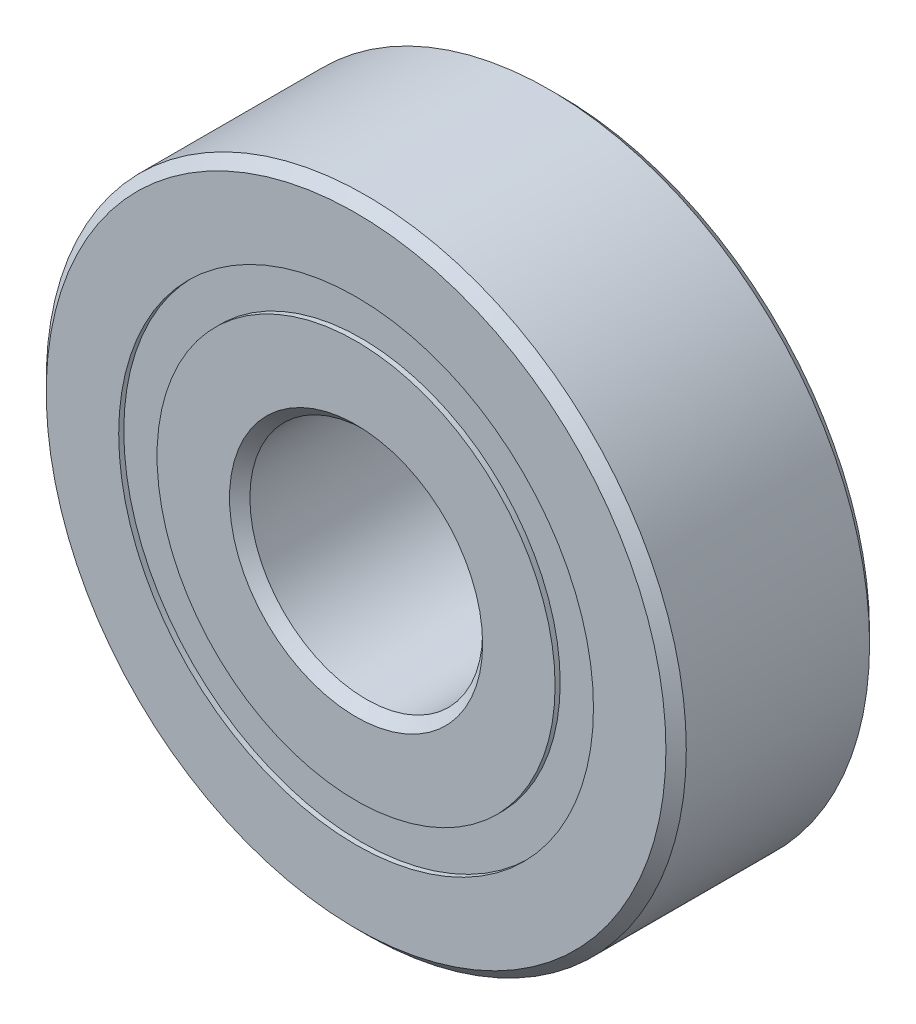
ISO-10303-21;
HEADER;
FILE_DESCRIPTION(('STEP AP214'),'2;1');
FILE_NAME('part.step','',(''),(''),'','','');
FILE_SCHEMA(('AUTOMOTIVE_DESIGN { 1 0 10303 214 1 1 1 1 }'));
ENDSEC;
DATA;
#1=APPLICATION_CONTEXT('core data for automotive mechanical design processes');
#2=APPLICATION_PROTOCOL_DEFINITION('international standard','automotive_design',2000,#1);
#3=PRODUCT_CONTEXT('',#1,'mechanical');
#4=PRODUCT('Part','Part','',(#3));
#5=PRODUCT_RELATED_PRODUCT_CATEGORY('part','',(#4));
#6=PRODUCT_DEFINITION_FORMATION('','',#4);
#7=PRODUCT_DEFINITION_CONTEXT('part definition',#1,'design');
#8=PRODUCT_DEFINITION('design','',#6,#7);
#9=PRODUCT_DEFINITION_SHAPE('','',#8);
#10=(LENGTH_UNIT() NAMED_UNIT(*) SI_UNIT(.MILLI.,.METRE.));
#11=(NAMED_UNIT(*) PLANE_ANGLE_UNIT() SI_UNIT($,.RADIAN.));
#12=(NAMED_UNIT(*) SI_UNIT($,.STERADIAN.) SOLID_ANGLE_UNIT());
#13=UNCERTAINTY_MEASURE_WITH_UNIT(LENGTH_MEASURE(1.E-05),#10,'distance_accuracy_value','');
#14=(GEOMETRIC_REPRESENTATION_CONTEXT(3) GLOBAL_UNCERTAINTY_ASSIGNED_CONTEXT((#13)) GLOBAL_UNIT_ASSIGNED_CONTEXT((#10,
#11,#12)) REPRESENTATION_CONTEXT('',''));
#15=CARTESIAN_POINT('',(0.,0.,0.));
#16=DIRECTION('',(0.,0.,1.));
#17=DIRECTION('',(1.,0.,0.));
#18=AXIS2_PLACEMENT_3D('',#15,#16,#17);
#19=CARTESIAN_POINT('',(-3.74999999999992,6.49519052838334,0.));
#20=DIRECTION('',(0.,0.,1.));
#21=DIRECTION('',(-0.499999999999989,0.866025403784445,0.));
#22=AXIS2_PLACEMENT_3D('',#19,#20,#21);
#23=SPHERICAL_SURFACE('',#22,1.68952158656808);
#24=CARTESIAN_POINT('',(-3.74999999999992,6.49519052838334,1.68952158656808));
#25=VERTEX_POINT('',#24);
#26=VERTEX_LOOP('',#25);
#27=FACE_BOUND('',#26,.T.);
#28=ADVANCED_FACE('F39',(#27),#23,.T.);
#29=CLOSED_SHELL('',(#28));
#30=MANIFOLD_SOLID_BREP('B2',#29);
#31=CARTESIAN_POINT('',(-6.49519052838325,3.75000000000008,0.));
#32=DIRECTION('',(0.,0.,1.));
#33=DIRECTION('',(-0.866025403784433,0.50000000000001,0.));
#34=AXIS2_PLACEMENT_3D('',#31,#32,#33);
#35=SPHERICAL_SURFACE('',#34,1.68952158656808);
#36=CARTESIAN_POINT('',(-6.49519052838325,3.75000000000008,1.68952158656808));
#37=VERTEX_POINT('',#36);
#38=VERTEX_LOOP('',#37);
#39=FACE_BOUND('',#38,.T.);
#40=ADVANCED_FACE('F59',(#39),#35,.T.);
#41=CLOSED_SHELL('',(#40));
#42=MANIFOLD_SOLID_BREP('B6',#41);
#43=CARTESIAN_POINT('',(-7.50000000000001,0.,0.));
#44=DIRECTION('',(0.,0.,1.));
#45=DIRECTION('',(-1.,0.,0.));
#46=AXIS2_PLACEMENT_3D('',#43,#44,#45);
#47=SPHERICAL_SURFACE('',#46,1.68952158656808);
#48=CARTESIAN_POINT('',(-7.50000000000001,0.,1.68952158656808));
#49=VERTEX_POINT('',#48);
#50=VERTEX_LOOP('',#49);
#51=FACE_BOUND('',#50,.T.);
#52=ADVANCED_FACE('F79',(#51),#47,.T.);
#53=CLOSED_SHELL('',(#52));
#54=MANIFOLD_SOLID_BREP('B35',#53);
#55=CARTESIAN_POINT('',(-6.49519052838333,-3.74999999999994,0.));
#56=DIRECTION('',(0.,0.,1.));
#57=DIRECTION('',(-0.866025403784443,-0.499999999999992,0.));
#58=AXIS2_PLACEMENT_3D('',#55,#56,#57);
#59=SPHERICAL_SURFACE('',#58,1.68952158656808);
#60=CARTESIAN_POINT('',(-6.49519052838333,-3.74999999999994,1.68952158656808));
#61=VERTEX_POINT('',#60);
#62=VERTEX_LOOP('',#61);
#63=FACE_BOUND('',#62,.T.);
#64=ADVANCED_FACE('F99',(#63),#59,.T.);
#65=CLOSED_SHELL('',(#64));
#66=MANIFOLD_SOLID_BREP('B55',#65);
#67=CARTESIAN_POINT('',(-3.75000000000006,-6.49519052838327,0.));
#68=DIRECTION('',(0.,0.,1.));
#69=DIRECTION('',(-0.500000000000007,-0.866025403784435,0.));
#70=AXIS2_PLACEMENT_3D('',#67,#68,#69);
#71=SPHERICAL_SURFACE('',#70,1.68952158656808);
#72=CARTESIAN_POINT('',(-3.75000000000006,-6.49519052838327,1.68952158656808));
#73=VERTEX_POINT('',#72);
#74=VERTEX_LOOP('',#73);
#75=FACE_BOUND('',#74,.T.);
#76=ADVANCED_FACE('F119',(#75),#71,.T.);
#77=CLOSED_SHELL('',(#76));
#78=MANIFOLD_SOLID_BREP('B75',#77);
#79=CARTESIAN_POINT('',(0.,-7.50000000000001,0.));
#80=DIRECTION('',(0.,0.,1.));
#81=DIRECTION('',(0.,-1.,0.));
#82=AXIS2_PLACEMENT_3D('',#79,#80,#81);
#83=SPHERICAL_SURFACE('',#82,1.68952158656808);
#84=CARTESIAN_POINT('',(0.,-7.50000000000001,1.68952158656808));
#85=VERTEX_POINT('',#84);
#86=VERTEX_LOOP('',#85);
#87=FACE_BOUND('',#86,.T.);
#88=ADVANCED_FACE('F139',(#87),#83,.T.);
#89=CLOSED_SHELL('',(#88));
#90=MANIFOLD_SOLID_BREP('B95',#89);
#91=CARTESIAN_POINT('',(3.74999999999997,-6.49519052838332,0.));
#92=DIRECTION('',(0.,0.,1.));
#93=DIRECTION('',(0.499999999999995,-0.866025403784442,0.));
#94=AXIS2_PLACEMENT_3D('',#91,#92,#93);
#95=SPHERICAL_SURFACE('',#94,1.68952158656808);
#96=CARTESIAN_POINT('',(3.74999999999997,-6.49519052838332,1.68952158656808));
#97=VERTEX_POINT('',#96);
#98=VERTEX_LOOP('',#97);
#99=FACE_BOUND('',#98,.T.);
#100=ADVANCED_FACE('F159',(#99),#95,.T.);
#101=CLOSED_SHELL('',(#100));
#102=MANIFOLD_SOLID_BREP('B115',#101);
#103=CARTESIAN_POINT('',(6.49519052838328,-3.75000000000003,0.));
#104=DIRECTION('',(0.,0.,1.));
#105=DIRECTION('',(0.866025403784436,-0.500000000000004,0.));
#106=AXIS2_PLACEMENT_3D('',#103,#104,#105);
#107=SPHERICAL_SURFACE('',#106,1.68952158656808);
#108=CARTESIAN_POINT('',(6.49519052838328,-3.75000000000003,1.68952158656808));
#109=VERTEX_POINT('',#108);
#110=VERTEX_LOOP('',#109);
#111=FACE_BOUND('',#110,.T.);
#112=ADVANCED_FACE('F179',(#111),#107,.T.);
#113=CLOSED_SHELL('',(#112));
#114=MANIFOLD_SOLID_BREP('B135',#113);
#115=CARTESIAN_POINT('',(7.50000000000001,0.,0.));
#116=DIRECTION('',(0.,0.,1.));
#117=DIRECTION('',(1.,0.,0.));
#118=AXIS2_PLACEMENT_3D('',#115,#116,#117);
#119=SPHERICAL_SURFACE('',#118,1.68952158656808);
#120=CARTESIAN_POINT('',(7.50000000000001,0.,1.68952158656808));
#121=VERTEX_POINT('',#120);
#122=VERTEX_LOOP('',#121);
#123=FACE_BOUND('',#122,.T.);
#124=ADVANCED_FACE('F199',(#123),#119,.T.);
#125=CLOSED_SHELL('',(#124));
#126=MANIFOLD_SOLID_BREP('B155',#125);
#127=CARTESIAN_POINT('',(6.4951905283833,3.74999999999999,0.));
#128=DIRECTION('',(0.,0.,1.));
#129=DIRECTION('',(0.86602540378444,0.499999999999998,0.));
#130=AXIS2_PLACEMENT_3D('',#127,#128,#129);
#131=SPHERICAL_SURFACE('',#130,1.68952158656808);
#132=CARTESIAN_POINT('',(6.4951905283833,3.74999999999999,1.68952158656808));
#133=VERTEX_POINT('',#132);
#134=VERTEX_LOOP('',#133);
#135=FACE_BOUND('',#134,.T.);
#136=ADVANCED_FACE('F219',(#135),#131,.T.);
#137=CLOSED_SHELL('',(#136));
#138=MANIFOLD_SOLID_BREP('B175',#137);
#139=CARTESIAN_POINT('',(3.75000000000001,6.49519052838329,0.));
#140=DIRECTION('',(0.,0.,1.));
#141=DIRECTION('',(0.500000000000001,0.866025403784438,0.));
#142=AXIS2_PLACEMENT_3D('',#139,#140,#141);
#143=SPHERICAL_SURFACE('',#142,1.68952158656808);
#144=CARTESIAN_POINT('',(3.75000000000001,6.49519052838329,1.68952158656808));
#145=VERTEX_POINT('',#144);
#146=VERTEX_LOOP('',#145);
#147=FACE_BOUND('',#146,.T.);
#148=ADVANCED_FACE('F239',(#147),#143,.T.);
#149=CLOSED_SHELL('',(#148));
#150=MANIFOLD_SOLID_BREP('B195',#149);
#151=CARTESIAN_POINT('',(0.,7.50000000000001,0.));
#152=DIRECTION('',(0.,0.,1.));
#153=DIRECTION('',(0.,1.,0.));
#154=AXIS2_PLACEMENT_3D('',#151,#152,#153);
#155=SPHERICAL_SURFACE('',#154,1.68952158656808);
#156=CARTESIAN_POINT('',(0.,7.50000000000001,1.68952158656808));
#157=VERTEX_POINT('',#156);
#158=VERTEX_LOOP('',#157);
#159=FACE_BOUND('',#158,.T.);
#160=ADVANCED_FACE('F260',(#159),#155,.T.);
#161=CLOSED_SHELL('',(#160));
#162=MANIFOLD_SOLID_BREP('B215',#161);
#163=CARTESIAN_POINT('',(0.,0.,3.5));
#164=DIRECTION('',(0.,0.,1.));
#165=DIRECTION('',(1.,0.,0.));
#166=AXIS2_PLACEMENT_3D('',#163,#164,#165);
#167=CYLINDRICAL_SURFACE('',#166,8.15934065934067);
#168=CARTESIAN_POINT('',(0.,0.,-3.5));
#169=DIRECTION('',(0.,0.,1.));
#170=DIRECTION('',(1.,0.,0.));
#171=AXIS2_PLACEMENT_3D('',#168,#169,#170);
#172=CIRCLE('',#171,8.15934065934067);
#173=CARTESIAN_POINT('',(8.15934065934067,0.,-3.5));
#174=VERTEX_POINT('',#173);
#175=EDGE_CURVE('E312',#174,#174,#172,.T.);
#176=ORIENTED_EDGE('',*,*,#175,.F.);
#177=EDGE_LOOP('',(#176));
#178=FACE_BOUND('',#177,.T.);
#179=CARTESIAN_POINT('',(0.,0.,-3.325));
#180=DIRECTION('',(0.,0.,1.));
#181=DIRECTION('',(1.,0.,0.));
#182=AXIS2_PLACEMENT_3D('',#179,#180,#181);
#183=CIRCLE('',#182,8.15934065934067);
#184=CARTESIAN_POINT('',(8.15934065934067,0.,-3.325));
#185=VERTEX_POINT('',#184);
#186=EDGE_CURVE('E259',#185,#185,#183,.F.);
#187=ORIENTED_EDGE('',*,*,#186,.F.);
#188=EDGE_LOOP('',(#187));
#189=FACE_BOUND('',#188,.T.);
#190=ADVANCED_FACE('F273',(#178,#189),#167,.F.);
#191=CARTESIAN_POINT('',(0.,0.,3.5));
#192=DIRECTION('',(0.,0.,1.));
#193=DIRECTION('',(1.,0.,0.));
#194=AXIS2_PLACEMENT_3D('',#191,#192,#193);
#195=CYLINDRICAL_SURFACE('',#194,6.84065934065935);
#196=CARTESIAN_POINT('',(0.,0.,-3.5));
#197=DIRECTION('',(0.,0.,1.));
#198=DIRECTION('',(1.,0.,0.));
#199=AXIS2_PLACEMENT_3D('',#196,#197,#198);
#200=CIRCLE('',#199,6.84065934065935);
#201=CARTESIAN_POINT('',(6.84065934065935,0.,-3.5));
#202=VERTEX_POINT('',#201);
#203=EDGE_CURVE('E339',#202,#202,#200,.T.);
#204=ORIENTED_EDGE('',*,*,#203,.T.);
#205=EDGE_LOOP('',(#204));
#206=FACE_BOUND('',#205,.T.);
#207=CARTESIAN_POINT('',(0.,0.,-3.325));
#208=DIRECTION('',(0.,0.,1.));
#209=DIRECTION('',(1.,0.,0.));
#210=AXIS2_PLACEMENT_3D('',#207,#208,#209);
#211=CIRCLE('',#210,6.84065934065935);
#212=CARTESIAN_POINT('',(6.84065934065935,0.,-3.325));
#213=VERTEX_POINT('',#212);
#214=EDGE_CURVE('E285',#213,#213,#211,.T.);
#215=ORIENTED_EDGE('',*,*,#214,.F.);
#216=EDGE_LOOP('',(#215));
#217=FACE_BOUND('',#216,.T.);
#218=ADVANCED_FACE('F381',(#206,#217),#195,.T.);
#219=CARTESIAN_POINT('',(0.,0.,3.5));
#220=DIRECTION('',(0.,0.,1.));
#221=DIRECTION('',(1.,0.,0.));
#222=AXIS2_PLACEMENT_3D('',#219,#220,#221);
#223=CYLINDRICAL_SURFACE('',#222,8.15934065934067);
#224=CARTESIAN_POINT('',(0.,0.,3.5));
#225=DIRECTION('',(0.,0.,1.));
#226=DIRECTION('',(1.,0.,0.));
#227=AXIS2_PLACEMENT_3D('',#224,#225,#226);
#228=CIRCLE('',#227,8.15934065934067);
#229=CARTESIAN_POINT('',(8.15934065934067,0.,3.5));
#230=VERTEX_POINT('',#229);
#231=EDGE_CURVE('E303',#230,#230,#228,.T.);
#232=ORIENTED_EDGE('',*,*,#231,.T.);
#233=EDGE_LOOP('',(#232));
#234=FACE_BOUND('',#233,.T.);
#235=CARTESIAN_POINT('',(0.,0.,3.325));
#236=DIRECTION('',(0.,0.,-1.));
#237=DIRECTION('',(-1.,0.,0.));
#238=AXIS2_PLACEMENT_3D('',#235,#236,#237);
#239=CIRCLE('',#238,8.15934065934067);
#240=CARTESIAN_POINT('',(-8.15934065934067,0.,3.325));
#241=VERTEX_POINT('',#240);
#242=EDGE_CURVE('E294',#241,#241,#239,.F.);
#243=ORIENTED_EDGE('',*,*,#242,.F.);
#244=EDGE_LOOP('',(#243));
#245=FACE_BOUND('',#244,.T.);
#246=ADVANCED_FACE('F379',(#234,#245),#223,.F.);
#247=CARTESIAN_POINT('',(0.,0.,3.15));
#248=DIRECTION('',(0.,0.,-1.));
#249=DIRECTION('',(-1.,0.,0.));
#250=AXIS2_PLACEMENT_3D('',#247,#248,#249);
#251=CONICAL_SURFACE('',#250,11.,0.78539816339745);
#252=CARTESIAN_POINT('',(0.,0.,3.5));
#253=DIRECTION('',(0.,0.,1.));
#254=DIRECTION('',(1.,0.,0.));
#255=AXIS2_PLACEMENT_3D('',#252,#253,#254);
#256=CIRCLE('',#255,10.65);
#257=CARTESIAN_POINT('',(10.65,0.,3.5));
#258=VERTEX_POINT('',#257);
#259=EDGE_CURVE('E300',#258,#258,#256,.T.);
#260=ORIENTED_EDGE('',*,*,#259,.F.);
#261=EDGE_LOOP('',(#260));
#262=FACE_BOUND('',#261,.T.);
#263=CARTESIAN_POINT('',(0.,0.,3.15));
#264=DIRECTION('',(0.,0.,1.));
#265=DIRECTION('',(1.,0.,0.));
#266=AXIS2_PLACEMENT_3D('',#263,#264,#265);
#267=CIRCLE('',#266,11.);
#268=CARTESIAN_POINT('',(11.,0.,3.15));
#269=VERTEX_POINT('',#268);
#270=EDGE_CURVE('E321',#269,#269,#267,.T.);
#271=ORIENTED_EDGE('',*,*,#270,.T.);
#272=EDGE_LOOP('',(#271));
#273=FACE_BOUND('',#272,.T.);
#274=ADVANCED_FACE('F275',(#262,#273),#251,.T.);
#275=CARTESIAN_POINT('',(0.,10.65,3.5));
#276=DIRECTION('',(0.,0.,-1.));
#277=DIRECTION('',(-1.,0.,0.));
#278=AXIS2_PLACEMENT_3D('',#275,#276,#277);
#279=PLANE('',#278);
#280=ORIENTED_EDGE('',*,*,#231,.F.);
#281=EDGE_LOOP('',(#280));
#282=FACE_BOUND('',#281,.T.);
#283=ORIENTED_EDGE('',*,*,#259,.T.);
#284=EDGE_LOOP('',(#283));
#285=FACE_BOUND('',#284,.T.);
#286=ADVANCED_FACE('F389',(#282,#285),#279,.F.);
#287=CARTESIAN_POINT('',(0.,10.65,-3.5));
#288=DIRECTION('',(0.,0.,1.));
#289=DIRECTION('',(1.,0.,0.));
#290=AXIS2_PLACEMENT_3D('',#287,#288,#289);
#291=PLANE('',#290);
#292=CARTESIAN_POINT('',(0.,0.,-3.5));
#293=DIRECTION('',(0.,0.,1.));
#294=DIRECTION('',(1.,0.,0.));
#295=AXIS2_PLACEMENT_3D('',#292,#293,#294);
#296=CIRCLE('',#295,10.65);
#297=CARTESIAN_POINT('',(10.65,0.,-3.5));
#298=VERTEX_POINT('',#297);
#299=EDGE_CURVE('E315',#298,#298,#296,.T.);
#300=ORIENTED_EDGE('',*,*,#299,.F.);
#301=EDGE_LOOP('',(#300));
#302=FACE_BOUND('',#301,.T.);
#303=ORIENTED_EDGE('',*,*,#175,.T.);
#304=EDGE_LOOP('',(#303));
#305=FACE_BOUND('',#304,.T.);
#306=ADVANCED_FACE('F451',(#302,#305),#291,.F.);
#307=CARTESIAN_POINT('',(0.,0.,-3.5));
#308=DIRECTION('',(0.,0.,1.));
#309=DIRECTION('',(1.,0.,0.));
#310=AXIS2_PLACEMENT_3D('',#307,#308,#309);
#311=CONICAL_SURFACE('',#310,10.65,0.785398163397459);
#312=CARTESIAN_POINT('',(0.,0.,-3.15));
#313=DIRECTION('',(0.,0.,1.));
#314=DIRECTION('',(1.,0.,0.));
#315=AXIS2_PLACEMENT_3D('',#312,#313,#314);
#316=CIRCLE('',#315,11.);
#317=CARTESIAN_POINT('',(11.,0.,-3.15));
#318=VERTEX_POINT('',#317);
#319=EDGE_CURVE('E318',#318,#318,#316,.T.);
#320=ORIENTED_EDGE('',*,*,#319,.F.);
#321=EDGE_LOOP('',(#320));
#322=FACE_BOUND('',#321,.T.);
#323=ORIENTED_EDGE('',*,*,#299,.T.);
#324=EDGE_LOOP('',(#323));
#325=FACE_BOUND('',#324,.T.);
#326=ADVANCED_FACE('F448',(#322,#325),#311,.T.);
#327=CARTESIAN_POINT('',(0.,0.,3.5));
#328=DIRECTION('',(0.,0.,1.));
#329=DIRECTION('',(1.,0.,0.));
#330=AXIS2_PLACEMENT_3D('',#327,#328,#329);
#331=CYLINDRICAL_SURFACE('',#330,11.);
#332=ORIENTED_EDGE('',*,*,#270,.F.);
#333=EDGE_LOOP('',(#332));
#334=FACE_BOUND('',#333,.T.);
#335=ORIENTED_EDGE('',*,*,#319,.T.);
#336=EDGE_LOOP('',(#335));
#337=FACE_BOUND('',#336,.T.);
#338=ADVANCED_FACE('F375',(#334,#337),#331,.T.);
#339=CARTESIAN_POINT('',(0.,8.15934065934067,3.325));
#340=DIRECTION('',(0.,0.,-1.));
#341=DIRECTION('',(-1.,0.,0.));
#342=AXIS2_PLACEMENT_3D('',#339,#340,#341);
#343=PLANE('',#342);
#344=CARTESIAN_POINT('',(0.,0.,3.325));
#345=DIRECTION('',(0.,0.,1.));
#346=DIRECTION('',(1.,0.,0.));
#347=AXIS2_PLACEMENT_3D('',#344,#345,#346);
#348=CIRCLE('',#347,6.84065934065935);
#349=CARTESIAN_POINT('',(6.84065934065935,0.,3.325));
#350=VERTEX_POINT('',#349);
#351=EDGE_CURVE('E324',#350,#350,#348,.T.);
#352=ORIENTED_EDGE('',*,*,#351,.F.);
#353=EDGE_LOOP('',(#352));
#354=FACE_BOUND('',#353,.T.);
#355=ORIENTED_EDGE('',*,*,#242,.T.);
#356=EDGE_LOOP('',(#355));
#357=FACE_BOUND('',#356,.T.);
#358=ADVANCED_FACE('F368',(#354,#357),#343,.F.);
#359=CARTESIAN_POINT('',(0.,0.,3.5));
#360=DIRECTION('',(0.,0.,1.));
#361=DIRECTION('',(1.,0.,0.));
#362=AXIS2_PLACEMENT_3D('',#359,#360,#361);
#363=CYLINDRICAL_SURFACE('',#362,6.84065934065935);
#364=CARTESIAN_POINT('',(0.,0.,3.5));
#365=DIRECTION('',(0.,0.,1.));
#366=DIRECTION('',(1.,0.,0.));
#367=AXIS2_PLACEMENT_3D('',#364,#365,#366);
#368=CIRCLE('',#367,6.84065934065935);
#369=CARTESIAN_POINT('',(6.84065934065935,0.,3.5));
#370=VERTEX_POINT('',#369);
#371=EDGE_CURVE('E348',#370,#370,#368,.T.);
#372=ORIENTED_EDGE('',*,*,#371,.F.);
#373=EDGE_LOOP('',(#372));
#374=FACE_BOUND('',#373,.T.);
#375=ORIENTED_EDGE('',*,*,#351,.T.);
#376=EDGE_LOOP('',(#375));
#377=FACE_BOUND('',#376,.T.);
#378=ADVANCED_FACE('F365',(#374,#377),#363,.T.);
#379=CARTESIAN_POINT('',(0.,0.,3.5));
#380=DIRECTION('',(0.,0.,1.));
#381=DIRECTION('',(1.,0.,0.));
#382=AXIS2_PLACEMENT_3D('',#379,#380,#381);
#383=CONICAL_SURFACE('',#382,4.35000000000002,0.785398163397462);
#384=CARTESIAN_POINT('',(0.,0.,3.15));
#385=DIRECTION('',(0.,0.,1.));
#386=DIRECTION('',(1.,0.,0.));
#387=AXIS2_PLACEMENT_3D('',#384,#385,#386);
#388=CIRCLE('',#387,4.00000000000001);
#389=CARTESIAN_POINT('',(4.00000000000001,0.,3.15));
#390=VERTEX_POINT('',#389);
#391=EDGE_CURVE('E330',#390,#390,#388,.T.);
#392=ORIENTED_EDGE('',*,*,#391,.F.);
#393=EDGE_LOOP('',(#392));
#394=FACE_BOUND('',#393,.T.);
#395=CARTESIAN_POINT('',(0.,0.,3.5));
#396=DIRECTION('',(0.,0.,1.));
#397=DIRECTION('',(1.,0.,0.));
#398=AXIS2_PLACEMENT_3D('',#395,#396,#397);
#399=CIRCLE('',#398,4.35000000000002);
#400=CARTESIAN_POINT('',(4.35000000000002,0.,3.5));
#401=VERTEX_POINT('',#400);
#402=EDGE_CURVE('E351',#401,#401,#399,.T.);
#403=ORIENTED_EDGE('',*,*,#402,.T.);
#404=EDGE_LOOP('',(#403));
#405=FACE_BOUND('',#404,.T.);
#406=ADVANCED_FACE('F355',(#394,#405),#383,.F.);
#407=CARTESIAN_POINT('',(0.,0.,3.5));
#408=DIRECTION('',(0.,0.,1.));
#409=DIRECTION('',(1.,0.,0.));
#410=AXIS2_PLACEMENT_3D('',#407,#408,#409);
#411=CYLINDRICAL_SURFACE('',#410,4.00000000000001);
#412=CARTESIAN_POINT('',(0.,0.,-3.15));
#413=DIRECTION('',(0.,0.,1.));
#414=DIRECTION('',(1.,0.,0.));
#415=AXIS2_PLACEMENT_3D('',#412,#413,#414);
#416=CIRCLE('',#415,4.00000000000001);
#417=CARTESIAN_POINT('',(4.00000000000001,0.,-3.15));
#418=VERTEX_POINT('',#417);
#419=EDGE_CURVE('E333',#418,#418,#416,.T.);
#420=ORIENTED_EDGE('',*,*,#419,.F.);
#421=EDGE_LOOP('',(#420));
#422=FACE_BOUND('',#421,.T.);
#423=ORIENTED_EDGE('',*,*,#391,.T.);
#424=EDGE_LOOP('',(#423));
#425=FACE_BOUND('',#424,.T.);
#426=ADVANCED_FACE('F438',(#422,#425),#411,.F.);
#427=CARTESIAN_POINT('',(0.,0.,-3.15));
#428=DIRECTION('',(0.,0.,-1.));
#429=DIRECTION('',(-1.,0.,0.));
#430=AXIS2_PLACEMENT_3D('',#427,#428,#429);
#431=CONICAL_SURFACE('',#430,4.00000000000001,0.785398163397462);
#432=CARTESIAN_POINT('',(0.,0.,-3.5));
#433=DIRECTION('',(0.,0.,1.));
#434=DIRECTION('',(1.,0.,0.));
#435=AXIS2_PLACEMENT_3D('',#432,#433,#434);
#436=CIRCLE('',#435,4.35000000000002);
#437=CARTESIAN_POINT('',(4.35000000000002,0.,-3.5));
#438=VERTEX_POINT('',#437);
#439=EDGE_CURVE('E336',#438,#438,#436,.T.);
#440=ORIENTED_EDGE('',*,*,#439,.F.);
#441=EDGE_LOOP('',(#440));
#442=FACE_BOUND('',#441,.T.);
#443=ORIENTED_EDGE('',*,*,#419,.T.);
#444=EDGE_LOOP('',(#443));
#445=FACE_BOUND('',#444,.T.);
#446=ADVANCED_FACE('F434',(#442,#445),#431,.F.);
#447=CARTESIAN_POINT('',(0.,4.35000000000002,-3.5));
#448=DIRECTION('',(0.,0.,1.));
#449=DIRECTION('',(1.,0.,0.));
#450=AXIS2_PLACEMENT_3D('',#447,#448,#449);
#451=PLANE('',#450);
#452=ORIENTED_EDGE('',*,*,#203,.F.);
#453=EDGE_LOOP('',(#452));
#454=FACE_BOUND('',#453,.T.);
#455=ORIENTED_EDGE('',*,*,#439,.T.);
#456=EDGE_LOOP('',(#455));
#457=FACE_BOUND('',#456,.T.);
#458=ADVANCED_FACE('F361',(#454,#457),#451,.F.);
#459=CARTESIAN_POINT('',(0.,4.35000000000002,3.5));
#460=DIRECTION('',(0.,0.,-1.));
#461=DIRECTION('',(-1.,0.,0.));
#462=AXIS2_PLACEMENT_3D('',#459,#460,#461);
#463=PLANE('',#462);
#464=ORIENTED_EDGE('',*,*,#402,.F.);
#465=EDGE_LOOP('',(#464));
#466=FACE_BOUND('',#465,.T.);
#467=ORIENTED_EDGE('',*,*,#371,.T.);
#468=EDGE_LOOP('',(#467));
#469=FACE_BOUND('',#468,.T.);
#470=ADVANCED_FACE('F357',(#466,#469),#463,.F.);
#471=CARTESIAN_POINT('',(0.,8.15934065934067,-3.325));
#472=DIRECTION('',(0.,0.,1.));
#473=DIRECTION('',(1.,0.,0.));
#474=AXIS2_PLACEMENT_3D('',#471,#472,#473);
#475=PLANE('',#474);
#476=ORIENTED_EDGE('',*,*,#186,.T.);
#477=EDGE_LOOP('',(#476));
#478=FACE_BOUND('',#477,.T.);
#479=ORIENTED_EDGE('',*,*,#214,.T.);
#480=EDGE_LOOP('',(#479));
#481=FACE_BOUND('',#480,.T.);
#482=ADVANCED_FACE('F360',(#478,#481),#475,.F.);
#483=CLOSED_SHELL('',(#190,#218,#246,#274,#286,#306,#326,#338,#358,#378,#406,#426,#446,#458,
#470,#482));
#484=CARTESIAN_POINT('',(0.,8.15934065934067,-1.68952158656808));
#485=DIRECTION('',(0.,0.,-1.));
#486=DIRECTION('',(-1.,0.,0.));
#487=AXIS2_PLACEMENT_3D('',#484,#485,#486);
#488=PLANE('',#487);
#489=CARTESIAN_POINT('',(0.,0.,-1.68952158656808));
#490=DIRECTION('',(0.,0.,-1.));
#491=DIRECTION('',(-1.,0.,0.));
#492=AXIS2_PLACEMENT_3D('',#489,#490,#491);
#493=CIRCLE('',#492,6.84065934065935);
#494=CARTESIAN_POINT('',(-6.84065934065935,0.,-1.68952158656808));
#495=VERTEX_POINT('',#494);
#496=EDGE_CURVE('E289',#495,#495,#493,.T.);
#497=ORIENTED_EDGE('',*,*,#496,.T.);
#498=EDGE_LOOP('',(#497));
#499=FACE_BOUND('',#498,.T.);
#500=CARTESIAN_POINT('',(0.,0.,-1.68952158656808));
#501=DIRECTION('',(0.,0.,-1.));
#502=DIRECTION('',(-1.,0.,0.));
#503=AXIS2_PLACEMENT_3D('',#500,#501,#502);
#504=CIRCLE('',#503,8.15934065934067);
#505=CARTESIAN_POINT('',(-8.15934065934067,0.,-1.68952158656808));
#506=VERTEX_POINT('',#505);
#507=EDGE_CURVE('E281',#506,#506,#504,.F.);
#508=ORIENTED_EDGE('',*,*,#507,.T.);
#509=EDGE_LOOP('',(#508));
#510=FACE_BOUND('',#509,.T.);
#511=ADVANCED_FACE('F397',(#499,#510),#488,.F.);
#512=CARTESIAN_POINT('',(0.,0.,1.55555555555556));
#513=DIRECTION('',(0.,0.,1.));
#514=DIRECTION('',(1.,0.,0.));
#515=AXIS2_PLACEMENT_3D('',#512,#513,#514);
#516=CIRCLE('',#515,8.15934065934067);
#517=CARTESIAN_POINT('',(8.15934065934067,0.,1.55555555555556));
#518=VERTEX_POINT('',#517);
#519=EDGE_CURVE('E306',#518,#518,#516,.T.);
#520=ORIENTED_EDGE('',*,*,#519,.F.);
#521=EDGE_LOOP('',(#520));
#522=FACE_BOUND('',#521,.T.);
#523=CARTESIAN_POINT('',(0.,0.,1.68952158656808));
#524=DIRECTION('',(0.,0.,1.));
#525=DIRECTION('',(1.,0.,0.));
#526=AXIS2_PLACEMENT_3D('',#523,#524,#525);
#527=CIRCLE('',#526,8.15934065934067);
#528=CARTESIAN_POINT('',(8.15934065934067,0.,1.68952158656808));
#529=VERTEX_POINT('',#528);
#530=EDGE_CURVE('E297',#529,#529,#527,.F.);
#531=ORIENTED_EDGE('',*,*,#530,.F.);
#532=EDGE_LOOP('',(#531));
#533=FACE_BOUND('',#532,.T.);
#534=ADVANCED_FACE('F384',(#522,#533),#223,.F.);
#535=CARTESIAN_POINT('',(0.,0.,0.));
#536=DIRECTION('',(0.,0.,1.));
#537=DIRECTION('',(1.,0.,0.));
#538=AXIS2_PLACEMENT_3D('',#535,#536,#537);
#539=TOROIDAL_SURFACE('',#538,7.50000000000001,1.68952158656808);
#540=CARTESIAN_POINT('',(0.,0.,-1.55555555555556));
#541=DIRECTION('',(0.,0.,1.));
#542=DIRECTION('',(1.,0.,0.));
#543=AXIS2_PLACEMENT_3D('',#540,#541,#542);
#544=CIRCLE('',#543,8.15934065934067);
#545=CARTESIAN_POINT('',(8.15934065934067,0.,-1.55555555555556));
#546=VERTEX_POINT('',#545);
#547=EDGE_CURVE('E309',#546,#546,#544,.T.);
#548=ORIENTED_EDGE('',*,*,#547,.F.);
#549=EDGE_LOOP('',(#548));
#550=FACE_BOUND('',#549,.T.);
#551=ORIENTED_EDGE('',*,*,#519,.T.);
#552=EDGE_LOOP('',(#551));
#553=FACE_BOUND('',#552,.T.);
#554=ADVANCED_FACE('F396',(#550,#553),#539,.F.);
#555=ORIENTED_EDGE('',*,*,#547,.T.);
#556=EDGE_LOOP('',(#555));
#557=FACE_BOUND('',#556,.T.);
#558=ORIENTED_EDGE('',*,*,#507,.F.);
#559=EDGE_LOOP('',(#558));
#560=FACE_BOUND('',#559,.T.);
#561=ADVANCED_FACE('F403',(#557,#560),#167,.F.);
#562=CARTESIAN_POINT('',(0.,8.15934065934067,1.68952158656808));
#563=DIRECTION('',(0.,0.,1.));
#564=DIRECTION('',(1.,0.,0.));
#565=AXIS2_PLACEMENT_3D('',#562,#563,#564);
#566=PLANE('',#565);
#567=ORIENTED_EDGE('',*,*,#530,.T.);
#568=EDGE_LOOP('',(#567));
#569=FACE_BOUND('',#568,.T.);
#570=CARTESIAN_POINT('',(0.,0.,1.68952158656808));
#571=DIRECTION('',(0.,0.,1.));
#572=DIRECTION('',(1.,0.,0.));
#573=AXIS2_PLACEMENT_3D('',#570,#571,#572);
#574=CIRCLE('',#573,6.84065934065935);
#575=CARTESIAN_POINT('',(6.84065934065935,0.,1.68952158656808));
#576=VERTEX_POINT('',#575);
#577=EDGE_CURVE('E327',#576,#576,#574,.F.);
#578=ORIENTED_EDGE('',*,*,#577,.F.);
#579=EDGE_LOOP('',(#578));
#580=FACE_BOUND('',#579,.T.);
#581=ADVANCED_FACE('F410',(#569,#580),#566,.F.);
#582=CARTESIAN_POINT('',(0.,0.,1.55555555555556));
#583=DIRECTION('',(0.,0.,1.));
#584=DIRECTION('',(1.,0.,0.));
#585=AXIS2_PLACEMENT_3D('',#582,#583,#584);
#586=CIRCLE('',#585,6.84065934065935);
#587=CARTESIAN_POINT('',(6.84065934065935,0.,1.55555555555556));
#588=VERTEX_POINT('',#587);
#589=EDGE_CURVE('E345',#588,#588,#586,.T.);
#590=ORIENTED_EDGE('',*,*,#589,.T.);
#591=EDGE_LOOP('',(#590));
#592=FACE_BOUND('',#591,.T.);
#593=ORIENTED_EDGE('',*,*,#577,.T.);
#594=EDGE_LOOP('',(#593));
#595=FACE_BOUND('',#594,.T.);
#596=ADVANCED_FACE('F370',(#592,#595),#363,.T.);
#597=CARTESIAN_POINT('',(0.,0.,0.));
#598=DIRECTION('',(0.,0.,1.));
#599=DIRECTION('',(1.,0.,0.));
#600=AXIS2_PLACEMENT_3D('',#597,#598,#599);
#601=TOROIDAL_SURFACE('',#600,7.50000000000001,1.68952158656808);
#602=ORIENTED_EDGE('',*,*,#589,.F.);
#603=EDGE_LOOP('',(#602));
#604=FACE_BOUND('',#603,.T.);
#605=CARTESIAN_POINT('',(0.,0.,-1.55555555555556));
#606=DIRECTION('',(0.,0.,1.));
#607=DIRECTION('',(1.,0.,0.));
#608=AXIS2_PLACEMENT_3D('',#605,#606,#607);
#609=CIRCLE('',#608,6.84065934065935);
#610=CARTESIAN_POINT('',(6.84065934065935,0.,-1.55555555555556));
#611=VERTEX_POINT('',#610);
#612=EDGE_CURVE('E342',#611,#611,#609,.T.);
#613=ORIENTED_EDGE('',*,*,#612,.T.);
#614=EDGE_LOOP('',(#613));
#615=FACE_BOUND('',#614,.T.);
#616=ADVANCED_FACE('F428',(#604,#615),#601,.F.);
#617=ORIENTED_EDGE('',*,*,#612,.F.);
#618=EDGE_LOOP('',(#617));
#619=FACE_BOUND('',#618,.T.);
#620=ORIENTED_EDGE('',*,*,#496,.F.);
#621=EDGE_LOOP('',(#620));
#622=FACE_BOUND('',#621,.T.);
#623=ADVANCED_FACE('F393',(#619,#622),#195,.T.);
#624=CLOSED_SHELL('',(#511,#534,#554,#561,#581,#596,#616,#623));
#625=ORIENTED_CLOSED_SHELL('',*,#624,.T.);
#626=BREP_WITH_VOIDS('B235',#483,(#625));
#627=ADVANCED_BREP_SHAPE_REPRESENTATION('',(#18,#30,#42,#54,#66,#78,#90,#102,#114,#126,#138,
#150,#162,#626),#14);
#628=SHAPE_DEFINITION_REPRESENTATION(#9,#627);
ENDSEC;
END-ISO-10303-21;
